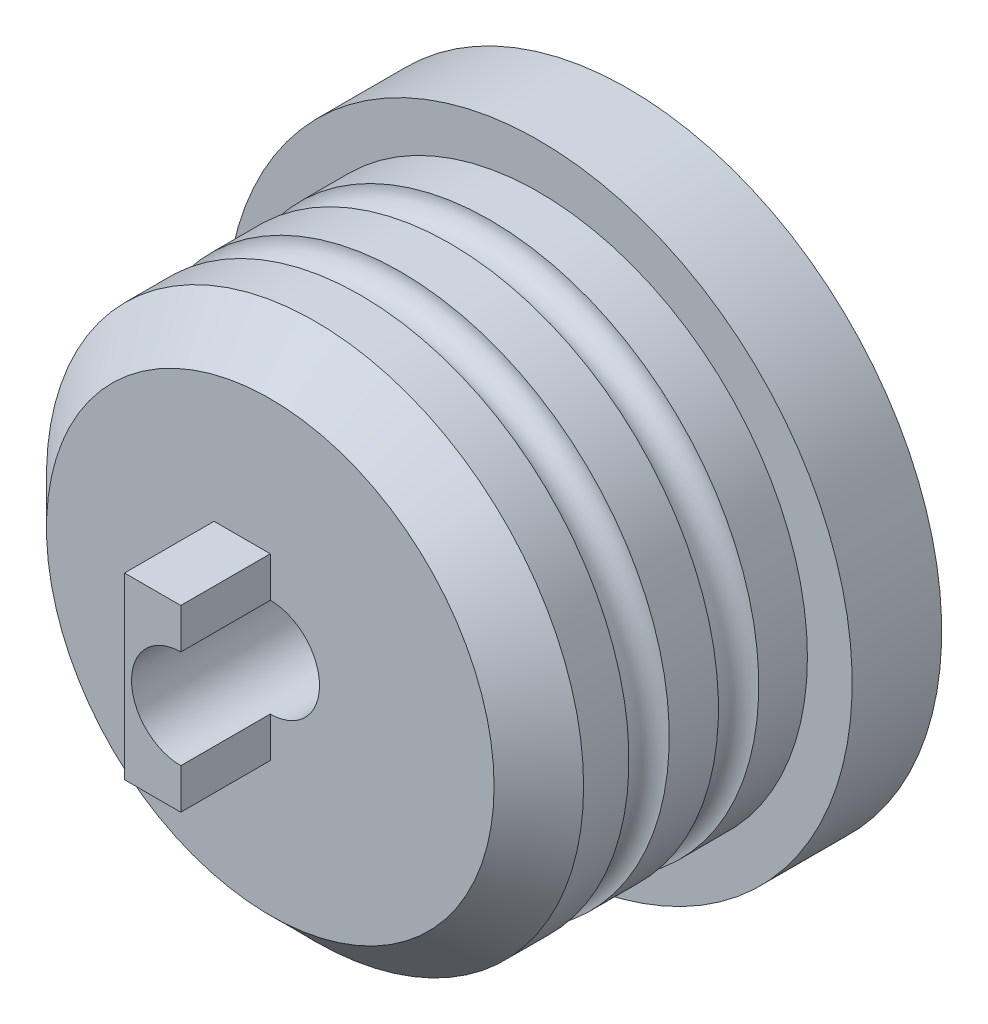
ISO-10303-21;
HEADER;
FILE_DESCRIPTION(('STEP AP214'),'2;1');
FILE_NAME('part.step','',(''),(''),'','','');
FILE_SCHEMA(('AUTOMOTIVE_DESIGN { 1 0 10303 214 1 1 1 1 }'));
ENDSEC;
DATA;
#1=APPLICATION_CONTEXT('core data for automotive mechanical design processes');
#2=APPLICATION_PROTOCOL_DEFINITION('international standard','automotive_design',2000,#1);
#3=PRODUCT_CONTEXT('',#1,'mechanical');
#4=PRODUCT('Part','Part','',(#3));
#5=PRODUCT_RELATED_PRODUCT_CATEGORY('part','',(#4));
#6=PRODUCT_DEFINITION_FORMATION('','',#4);
#7=PRODUCT_DEFINITION_CONTEXT('part definition',#1,'design');
#8=PRODUCT_DEFINITION('design','',#6,#7);
#9=PRODUCT_DEFINITION_SHAPE('','',#8);
#10=(LENGTH_UNIT() NAMED_UNIT(*) SI_UNIT(.MILLI.,.METRE.));
#11=(NAMED_UNIT(*) PLANE_ANGLE_UNIT() SI_UNIT($,.RADIAN.));
#12=(NAMED_UNIT(*) SI_UNIT($,.STERADIAN.) SOLID_ANGLE_UNIT());
#13=UNCERTAINTY_MEASURE_WITH_UNIT(LENGTH_MEASURE(1.E-05),#10,'distance_accuracy_value','');
#14=(GEOMETRIC_REPRESENTATION_CONTEXT(3) GLOBAL_UNCERTAINTY_ASSIGNED_CONTEXT((#13)) GLOBAL_UNIT_ASSIGNED_CONTEXT((#10,
#11,#12)) REPRESENTATION_CONTEXT('',''));
#15=CARTESIAN_POINT('',(0.,0.,0.));
#16=DIRECTION('',(0.,0.,1.));
#17=DIRECTION('',(1.,0.,0.));
#18=AXIS2_PLACEMENT_3D('',#15,#16,#17);
#19=CARTESIAN_POINT('',(0.,0.,30.));
#20=DIRECTION('',(0.,0.,-1.));
#21=DIRECTION('',(-1.,0.,0.));
#22=AXIS2_PLACEMENT_3D('',#19,#20,#21);
#23=CYLINDRICAL_SURFACE('',#22,30.);
#24=CARTESIAN_POINT('',(0.,0.,19.9375000013656));
#25=DIRECTION('',(0.,0.,-1.));
#26=DIRECTION('',(-1.,0.,0.));
#27=AXIS2_PLACEMENT_3D('',#24,#25,#26);
#28=CIRCLE('',#27,30.);
#29=CARTESIAN_POINT('',(0.,-30.,19.9375000013656));
#30=VERTEX_POINT('',#29);
#31=EDGE_CURVE('E11',#30,#30,#28,.F.);
#32=ORIENTED_EDGE('',*,*,#31,.T.);
#33=EDGE_LOOP('',(#32));
#34=FACE_BOUND('',#33,.T.);
#35=CARTESIAN_POINT('',(0.,0.,25.));
#36=DIRECTION('',(0.,0.,1.));
#37=DIRECTION('',(1.,0.,0.));
#38=AXIS2_PLACEMENT_3D('',#35,#36,#37);
#39=CIRCLE('',#38,30.);
#40=CARTESIAN_POINT('',(30.,0.,25.));
#41=VERTEX_POINT('',#40);
#42=EDGE_CURVE('E176',#41,#41,#39,.F.);
#43=ORIENTED_EDGE('',*,*,#42,.T.);
#44=EDGE_LOOP('',(#43));
#45=FACE_BOUND('',#44,.T.);
#46=ADVANCED_FACE('F39',(#34,#45),#23,.T.);
#47=CARTESIAN_POINT('',(0.,0.,15.4375000013656));
#48=DIRECTION('',(0.,0.,1.));
#49=DIRECTION('',(1.,0.,0.));
#50=AXIS2_PLACEMENT_3D('',#47,#48,#49);
#51=CIRCLE('',#50,30.);
#52=CARTESIAN_POINT('',(0.,-30.,15.4375000013656));
#53=VERTEX_POINT('',#52);
#54=EDGE_CURVE('E48',#53,#53,#51,.F.);
#55=ORIENTED_EDGE('',*,*,#54,.T.);
#56=EDGE_LOOP('',(#55));
#57=FACE_BOUND('',#56,.T.);
#58=CARTESIAN_POINT('',(0.,0.,9.93750000136557));
#59=DIRECTION('',(0.,0.,-1.));
#60=DIRECTION('',(-1.,0.,0.));
#61=AXIS2_PLACEMENT_3D('',#58,#59,#60);
#62=CIRCLE('',#61,30.);
#63=CARTESIAN_POINT('',(0.,-30.,9.93750000136557));
#64=VERTEX_POINT('',#63);
#65=EDGE_CURVE('E182',#64,#64,#62,.F.);
#66=ORIENTED_EDGE('',*,*,#65,.T.);
#67=EDGE_LOOP('',(#66));
#68=FACE_BOUND('',#67,.T.);
#69=ADVANCED_FACE('F186',(#57,#68),#23,.T.);
#70=CARTESIAN_POINT('',(0.,0.,5.43750000136557));
#71=DIRECTION('',(0.,0.,1.));
#72=DIRECTION('',(1.,0.,0.));
#73=AXIS2_PLACEMENT_3D('',#70,#71,#72);
#74=CIRCLE('',#73,30.);
#75=CARTESIAN_POINT('',(0.,-30.,5.43750000136557));
#76=VERTEX_POINT('',#75);
#77=EDGE_CURVE('E179',#76,#76,#74,.F.);
#78=ORIENTED_EDGE('',*,*,#77,.T.);
#79=EDGE_LOOP('',(#78));
#80=FACE_BOUND('',#79,.T.);
#81=CARTESIAN_POINT('',(0.,0.,0.));
#82=DIRECTION('',(0.,0.,1.));
#83=DIRECTION('',(1.,0.,0.));
#84=AXIS2_PLACEMENT_3D('',#81,#82,#83);
#85=CIRCLE('',#84,30.);
#86=CARTESIAN_POINT('',(30.,0.,0.));
#87=VERTEX_POINT('',#86);
#88=EDGE_CURVE('E168',#87,#87,#85,.T.);
#89=ORIENTED_EDGE('',*,*,#88,.T.);
#90=EDGE_LOOP('',(#89));
#91=FACE_BOUND('',#90,.T.);
#92=ADVANCED_FACE('F199',(#80,#91),#23,.T.);
#93=CARTESIAN_POINT('',(0.,0.,30.));
#94=DIRECTION('',(0.,0.,1.));
#95=DIRECTION('',(1.,0.,0.));
#96=AXIS2_PLACEMENT_3D('',#93,#94,#95);
#97=PLANE('',#96);
#98=DIRECTION('',(0.,1.,0.));
#99=VECTOR('',#98,1.);
#100=CARTESIAN_POINT('',(0.,10.,30.));
#101=LINE('',#100,#99);
#102=CARTESIAN_POINT('',(0.,5.5,30.));
#103=VERTEX_POINT('',#102);
#104=CARTESIAN_POINT('',(0.,10.,30.));
#105=VERTEX_POINT('',#104);
#106=EDGE_CURVE('E111',#103,#105,#101,.T.);
#107=ORIENTED_EDGE('',*,*,#106,.F.);
#108=CARTESIAN_POINT('',(0.,0.,30.));
#109=DIRECTION('',(0.,0.,1.));
#110=DIRECTION('',(1.,0.,0.));
#111=AXIS2_PLACEMENT_3D('',#108,#109,#110);
#112=CIRCLE('',#111,5.5);
#113=CARTESIAN_POINT('',(0.,-5.5,30.));
#114=VERTEX_POINT('',#113);
#115=EDGE_CURVE('E162',#103,#114,#112,.F.);
#116=ORIENTED_EDGE('',*,*,#115,.T.);
#117=DIRECTION('',(0.,1.,0.));
#118=VECTOR('',#117,1.);
#119=CARTESIAN_POINT('',(0.,-10.,30.));
#120=LINE('',#119,#118);
#121=CARTESIAN_POINT('',(0.,-10.,30.));
#122=VERTEX_POINT('',#121);
#123=EDGE_CURVE('E144',#122,#114,#120,.T.);
#124=ORIENTED_EDGE('',*,*,#123,.F.);
#125=DIRECTION('',(1.,0.,0.));
#126=VECTOR('',#125,1.);
#127=CARTESIAN_POINT('',(-2.5,-10.,30.));
#128=LINE('',#127,#126);
#129=CARTESIAN_POINT('',(-6.2844902883274,-10.,30.));
#130=VERTEX_POINT('',#129);
#131=EDGE_CURVE('E141',#130,#122,#128,.T.);
#132=ORIENTED_EDGE('',*,*,#131,.F.);
#133=DIRECTION('',(0.,-1.,0.));
#134=VECTOR('',#133,1.);
#135=CARTESIAN_POINT('',(-6.2844902883274,-10.,30.));
#136=LINE('',#135,#134);
#137=CARTESIAN_POINT('',(-6.2844902883274,10.,30.));
#138=VERTEX_POINT('',#137);
#139=EDGE_CURVE('E138',#138,#130,#136,.T.);
#140=ORIENTED_EDGE('',*,*,#139,.F.);
#141=DIRECTION('',(-1.,0.,0.));
#142=VECTOR('',#141,1.);
#143=CARTESIAN_POINT('',(-6.2844902883274,10.,30.));
#144=LINE('',#143,#142);
#145=EDGE_CURVE('E117',#105,#138,#144,.T.);
#146=ORIENTED_EDGE('',*,*,#145,.F.);
#147=EDGE_LOOP('',(#107,#116,#124,#132,#140,#146));
#148=FACE_BOUND('',#147,.T.);
#149=CARTESIAN_POINT('',(0.,0.,30.));
#150=DIRECTION('',(0.,0.,1.));
#151=DIRECTION('',(1.,0.,0.));
#152=AXIS2_PLACEMENT_3D('',#149,#150,#151);
#153=CIRCLE('',#152,25.);
#154=CARTESIAN_POINT('',(25.,0.,30.));
#155=VERTEX_POINT('',#154);
#156=EDGE_CURVE('E173',#155,#155,#153,.T.);
#157=ORIENTED_EDGE('',*,*,#156,.T.);
#158=EDGE_LOOP('',(#157));
#159=FACE_BOUND('',#158,.T.);
#160=ADVANCED_FACE('F206',(#148,#159),#97,.T.);
#161=CARTESIAN_POINT('',(0.,0.,-10.));
#162=DIRECTION('',(0.,0.,1.));
#163=DIRECTION('',(1.,0.,0.));
#164=AXIS2_PLACEMENT_3D('',#161,#162,#163);
#165=CYLINDRICAL_SURFACE('',#164,35.);
#166=CARTESIAN_POINT('',(0.,0.,-10.));
#167=DIRECTION('',(0.,0.,-1.));
#168=DIRECTION('',(-1.,0.,0.));
#169=AXIS2_PLACEMENT_3D('',#166,#167,#168);
#170=CIRCLE('',#169,35.);
#171=CARTESIAN_POINT('',(-35.,0.,-10.));
#172=VERTEX_POINT('',#171);
#173=EDGE_CURVE('E165',#172,#172,#170,.T.);
#174=ORIENTED_EDGE('',*,*,#173,.F.);
#175=EDGE_LOOP('',(#174));
#176=FACE_BOUND('',#175,.T.);
#177=CARTESIAN_POINT('',(0.,0.,0.));
#178=DIRECTION('',(0.,0.,-1.));
#179=DIRECTION('',(-1.,0.,0.));
#180=AXIS2_PLACEMENT_3D('',#177,#178,#179);
#181=CIRCLE('',#180,35.);
#182=CARTESIAN_POINT('',(-35.,0.,0.));
#183=VERTEX_POINT('',#182);
#184=EDGE_CURVE('E164',#183,#183,#181,.T.);
#185=ORIENTED_EDGE('',*,*,#184,.T.);
#186=EDGE_LOOP('',(#185));
#187=FACE_BOUND('',#186,.T.);
#188=ADVANCED_FACE('F211',(#176,#187),#165,.T.);
#189=CARTESIAN_POINT('',(0.,0.,-10.));
#190=DIRECTION('',(0.,0.,-1.));
#191=DIRECTION('',(-1.,0.,0.));
#192=AXIS2_PLACEMENT_3D('',#189,#190,#191);
#193=PLANE('',#192);
#194=CARTESIAN_POINT('',(0.,0.,-10.));
#195=DIRECTION('',(0.,0.,-1.));
#196=DIRECTION('',(-1.,0.,0.));
#197=AXIS2_PLACEMENT_3D('',#194,#195,#196);
#198=CIRCLE('',#197,5.5);
#199=CARTESIAN_POINT('',(-5.5,0.,-10.));
#200=VERTEX_POINT('',#199);
#201=EDGE_CURVE('E120',#200,#200,#198,.T.);
#202=ORIENTED_EDGE('',*,*,#201,.F.);
#203=EDGE_LOOP('',(#202));
#204=FACE_BOUND('',#203,.T.);
#205=ORIENTED_EDGE('',*,*,#173,.T.);
#206=EDGE_LOOP('',(#205));
#207=FACE_BOUND('',#206,.T.);
#208=ADVANCED_FACE('F220',(#204,#207),#193,.T.);
#209=CARTESIAN_POINT('',(0.,0.,0.));
#210=DIRECTION('',(0.,0.,-1.));
#211=DIRECTION('',(-1.,0.,0.));
#212=AXIS2_PLACEMENT_3D('',#209,#210,#211);
#213=PLANE('',#212);
#214=ORIENTED_EDGE('',*,*,#88,.F.);
#215=EDGE_LOOP('',(#214));
#216=FACE_BOUND('',#215,.T.);
#217=ORIENTED_EDGE('',*,*,#184,.F.);
#218=EDGE_LOOP('',(#217));
#219=FACE_BOUND('',#218,.T.);
#220=ADVANCED_FACE('F217',(#216,#219),#213,.F.);
#221=CARTESIAN_POINT('',(0.,0.,30.));
#222=DIRECTION('',(0.,0.,-1.));
#223=DIRECTION('',(-1.,0.,0.));
#224=AXIS2_PLACEMENT_3D('',#221,#222,#223);
#225=CONICAL_SURFACE('',#224,25.,0.785398163397448);
#226=ORIENTED_EDGE('',*,*,#42,.F.);
#227=EDGE_LOOP('',(#226));
#228=FACE_BOUND('',#227,.T.);
#229=ORIENTED_EDGE('',*,*,#156,.F.);
#230=EDGE_LOOP('',(#229));
#231=FACE_BOUND('',#230,.T.);
#232=ADVANCED_FACE('F42',(#228,#231),#225,.T.);
#233=CARTESIAN_POINT('',(0.,0.,45.556349186104));
#234=DIRECTION('',(0.,0.,-1.));
#235=DIRECTION('',(-1.,0.,0.));
#236=AXIS2_PLACEMENT_3D('',#233,#234,#235);
#237=CYLINDRICAL_SURFACE('',#236,5.5);
#238=ORIENTED_EDGE('',*,*,#201,.T.);
#239=EDGE_LOOP('',(#238));
#240=FACE_BOUND('',#239,.T.);
#241=ORIENTED_EDGE('',*,*,#115,.F.);
#242=DIRECTION('',(0.,0.,-1.));
#243=VECTOR('',#242,1.);
#244=CARTESIAN_POINT('',(0.,5.5,40.));
#245=LINE('',#244,#243);
#246=CARTESIAN_POINT('',(0.,5.5,40.));
#247=VERTEX_POINT('',#246);
#248=EDGE_CURVE('E150',#247,#103,#245,.T.);
#249=ORIENTED_EDGE('',*,*,#248,.F.);
#250=CARTESIAN_POINT('',(0.,0.,40.));
#251=DIRECTION('',(0.,0.,-1.));
#252=DIRECTION('',(1.,0.,0.));
#253=AXIS2_PLACEMENT_3D('',#250,#251,#252);
#254=CIRCLE('',#253,5.5);
#255=CARTESIAN_POINT('',(0.,-5.5,40.));
#256=VERTEX_POINT('',#255);
#257=EDGE_CURVE('E133',#256,#247,#254,.T.);
#258=ORIENTED_EDGE('',*,*,#257,.F.);
#259=DIRECTION('',(0.,0.,-1.));
#260=VECTOR('',#259,1.);
#261=CARTESIAN_POINT('',(0.,-5.5,40.));
#262=LINE('',#261,#260);
#263=EDGE_CURVE('E153',#256,#114,#262,.T.);
#264=ORIENTED_EDGE('',*,*,#263,.T.);
#265=EDGE_LOOP('',(#241,#249,#258,#264));
#266=FACE_BOUND('',#265,.T.);
#267=ADVANCED_FACE('F234',(#240,#266),#237,.F.);
#268=CARTESIAN_POINT('',(-6.2844902883274,10.,40.));
#269=DIRECTION('',(0.,-1.,0.));
#270=DIRECTION('',(0.,0.,-1.));
#271=AXIS2_PLACEMENT_3D('',#268,#269,#270);
#272=PLANE('',#271);
#273=ORIENTED_EDGE('',*,*,#145,.T.);
#274=DIRECTION('',(0.,0.,-1.));
#275=VECTOR('',#274,1.);
#276=CARTESIAN_POINT('',(-6.2844902883274,10.,40.));
#277=LINE('',#276,#275);
#278=CARTESIAN_POINT('',(-6.2844902883274,10.,40.));
#279=VERTEX_POINT('',#278);
#280=EDGE_CURVE('E115',#279,#138,#277,.T.);
#281=ORIENTED_EDGE('',*,*,#280,.F.);
#282=DIRECTION('',(-1.,0.,0.));
#283=VECTOR('',#282,1.);
#284=CARTESIAN_POINT('',(0.,10.,40.));
#285=LINE('',#284,#283);
#286=CARTESIAN_POINT('',(0.,10.,40.));
#287=VERTEX_POINT('',#286);
#288=EDGE_CURVE('E100',#287,#279,#285,.T.);
#289=ORIENTED_EDGE('',*,*,#288,.F.);
#290=DIRECTION('',(0.,0.,-1.));
#291=VECTOR('',#290,1.);
#292=CARTESIAN_POINT('',(0.,10.,40.));
#293=LINE('',#292,#291);
#294=EDGE_CURVE('E136',#287,#105,#293,.T.);
#295=ORIENTED_EDGE('',*,*,#294,.T.);
#296=EDGE_LOOP('',(#273,#281,#289,#295));
#297=FACE_BOUND('',#296,.T.);
#298=ADVANCED_FACE('F116',(#297),#272,.F.);
#299=CARTESIAN_POINT('',(-6.2844902883274,-10.,40.));
#300=DIRECTION('',(1.,0.,0.));
#301=DIRECTION('',(0.,0.,-1.));
#302=AXIS2_PLACEMENT_3D('',#299,#300,#301);
#303=PLANE('',#302);
#304=ORIENTED_EDGE('',*,*,#139,.T.);
#305=DIRECTION('',(0.,0.,-1.));
#306=VECTOR('',#305,1.);
#307=CARTESIAN_POINT('',(-6.2844902883274,-10.,40.));
#308=LINE('',#307,#306);
#309=CARTESIAN_POINT('',(-6.2844902883274,-10.,40.));
#310=VERTEX_POINT('',#309);
#311=EDGE_CURVE('E121',#310,#130,#308,.T.);
#312=ORIENTED_EDGE('',*,*,#311,.F.);
#313=DIRECTION('',(0.,-1.,0.));
#314=VECTOR('',#313,1.);
#315=CARTESIAN_POINT('',(-6.2844902883274,-10.,40.));
#316=LINE('',#315,#314);
#317=EDGE_CURVE('E104',#279,#310,#316,.T.);
#318=ORIENTED_EDGE('',*,*,#317,.F.);
#319=ORIENTED_EDGE('',*,*,#280,.T.);
#320=EDGE_LOOP('',(#304,#312,#318,#319));
#321=FACE_BOUND('',#320,.T.);
#322=ADVANCED_FACE('F123',(#321),#303,.F.);
#323=CARTESIAN_POINT('',(-2.5,-10.,40.));
#324=DIRECTION('',(0.,1.,0.));
#325=DIRECTION('',(0.,0.,1.));
#326=AXIS2_PLACEMENT_3D('',#323,#324,#325);
#327=PLANE('',#326);
#328=ORIENTED_EDGE('',*,*,#131,.T.);
#329=DIRECTION('',(0.,0.,-1.));
#330=VECTOR('',#329,1.);
#331=CARTESIAN_POINT('',(0.,-10.,40.));
#332=LINE('',#331,#330);
#333=CARTESIAN_POINT('',(0.,-10.,40.));
#334=VERTEX_POINT('',#333);
#335=EDGE_CURVE('E156',#334,#122,#332,.T.);
#336=ORIENTED_EDGE('',*,*,#335,.F.);
#337=DIRECTION('',(1.,0.,0.));
#338=VECTOR('',#337,1.);
#339=CARTESIAN_POINT('',(-3.5,-10.,40.));
#340=LINE('',#339,#338);
#341=EDGE_CURVE('E126',#310,#334,#340,.T.);
#342=ORIENTED_EDGE('',*,*,#341,.F.);
#343=ORIENTED_EDGE('',*,*,#311,.T.);
#344=EDGE_LOOP('',(#328,#336,#342,#343));
#345=FACE_BOUND('',#344,.T.);
#346=ADVANCED_FACE('F242',(#345),#327,.F.);
#347=CARTESIAN_POINT('',(0.,-10.,40.));
#348=DIRECTION('',(-1.,0.,0.));
#349=DIRECTION('',(0.,0.,1.));
#350=AXIS2_PLACEMENT_3D('',#347,#348,#349);
#351=PLANE('',#350);
#352=ORIENTED_EDGE('',*,*,#123,.T.);
#353=ORIENTED_EDGE('',*,*,#263,.F.);
#354=DIRECTION('',(0.,1.,0.));
#355=VECTOR('',#354,1.);
#356=CARTESIAN_POINT('',(0.,-10.,40.));
#357=LINE('',#356,#355);
#358=EDGE_CURVE('E128',#334,#256,#357,.T.);
#359=ORIENTED_EDGE('',*,*,#358,.F.);
#360=ORIENTED_EDGE('',*,*,#335,.T.);
#361=EDGE_LOOP('',(#352,#353,#359,#360));
#362=FACE_BOUND('',#361,.T.);
#363=ADVANCED_FACE('F245',(#362),#351,.F.);
#364=CARTESIAN_POINT('',(0.,10.,40.));
#365=DIRECTION('',(-1.,0.,0.));
#366=DIRECTION('',(0.,0.,1.));
#367=AXIS2_PLACEMENT_3D('',#364,#365,#366);
#368=PLANE('',#367);
#369=ORIENTED_EDGE('',*,*,#106,.T.);
#370=ORIENTED_EDGE('',*,*,#294,.F.);
#371=DIRECTION('',(0.,1.,0.));
#372=VECTOR('',#371,1.);
#373=CARTESIAN_POINT('',(0.,10.,40.));
#374=LINE('',#373,#372);
#375=EDGE_CURVE('E107',#247,#287,#374,.T.);
#376=ORIENTED_EDGE('',*,*,#375,.F.);
#377=ORIENTED_EDGE('',*,*,#248,.T.);
#378=EDGE_LOOP('',(#369,#370,#376,#377));
#379=FACE_BOUND('',#378,.T.);
#380=ADVANCED_FACE('F249',(#379),#368,.F.);
#381=CARTESIAN_POINT('',(0.,0.,40.));
#382=DIRECTION('',(0.,0.,1.));
#383=DIRECTION('',(1.,0.,0.));
#384=AXIS2_PLACEMENT_3D('',#381,#382,#383);
#385=PLANE('',#384);
#386=ORIENTED_EDGE('',*,*,#288,.T.);
#387=ORIENTED_EDGE('',*,*,#317,.T.);
#388=ORIENTED_EDGE('',*,*,#341,.T.);
#389=ORIENTED_EDGE('',*,*,#358,.T.);
#390=ORIENTED_EDGE('',*,*,#257,.T.);
#391=ORIENTED_EDGE('',*,*,#375,.T.);
#392=EDGE_LOOP('',(#386,#387,#388,#389,#390,#391));
#393=FACE_BOUND('',#392,.T.);
#394=ADVANCED_FACE('F102',(#393),#385,.T.);
#395=CARTESIAN_POINT('',(0.,0.,7.68750000136557));
#396=DIRECTION('',(0.,0.,1.));
#397=DIRECTION('',(1.,0.,0.));
#398=AXIS2_PLACEMENT_3D('',#395,#396,#397);
#399=TOROIDAL_SURFACE('',#398,30.,2.25);
#400=CARTESIAN_POINT('',(0.,-30.,7.68750000136557));
#401=DIRECTION('',(1.,0.,0.));
#402=DIRECTION('',(0.,0.,-1.));
#403=AXIS2_PLACEMENT_3D('',#400,#401,#402);
#404=CIRCLE('',#403,2.25);
#405=EDGE_CURVE('E139',#76,#64,#404,.T.);
#406=ORIENTED_EDGE('',*,*,#405,.F.);
#407=ORIENTED_EDGE('',*,*,#77,.F.);
#408=ORIENTED_EDGE('',*,*,#405,.T.);
#409=ORIENTED_EDGE('',*,*,#65,.F.);
#410=EDGE_LOOP('',(#406,#407,#408,#409));
#411=FACE_BOUND('',#410,.T.);
#412=ADVANCED_FACE('F190',(#411),#399,.F.);
#413=CARTESIAN_POINT('',(0.,0.,17.6875000013656));
#414=DIRECTION('',(0.,0.,1.));
#415=DIRECTION('',(1.,0.,0.));
#416=AXIS2_PLACEMENT_3D('',#413,#414,#415);
#417=TOROIDAL_SURFACE('',#416,30.,2.25);
#418=CARTESIAN_POINT('',(0.,-30.,17.6875000013656));
#419=DIRECTION('',(1.,0.,0.));
#420=DIRECTION('',(0.,0.,-1.));
#421=AXIS2_PLACEMENT_3D('',#418,#419,#420);
#422=CIRCLE('',#421,2.25);
#423=EDGE_CURVE('E55',#53,#30,#422,.T.);
#424=ORIENTED_EDGE('',*,*,#423,.F.);
#425=ORIENTED_EDGE('',*,*,#54,.F.);
#426=ORIENTED_EDGE('',*,*,#423,.T.);
#427=ORIENTED_EDGE('',*,*,#31,.F.);
#428=EDGE_LOOP('',(#424,#425,#426,#427));
#429=FACE_BOUND('',#428,.T.);
#430=ADVANCED_FACE('F188',(#429),#417,.F.);
#431=CLOSED_SHELL('',(#46,#69,#92,#160,#188,#208,#220,#232,#267,#298,#322,#346,#363,#380,#394,
#412,#430));
#432=MANIFOLD_SOLID_BREP('B2',#431);
#433=ADVANCED_BREP_SHAPE_REPRESENTATION('',(#18,#432),#14);
#434=SHAPE_DEFINITION_REPRESENTATION(#9,#433);
ENDSEC;
END-ISO-10303-21;
